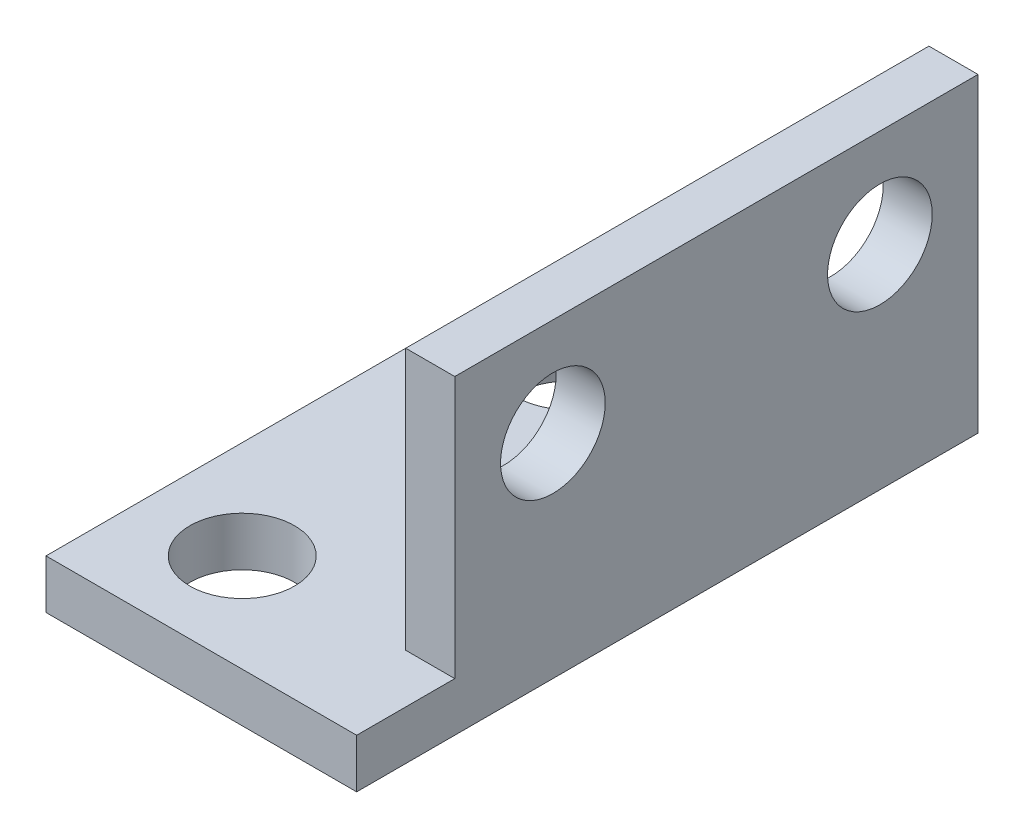
ISO-10303-21;
HEADER;
FILE_DESCRIPTION(('STEP AP214'),'2;1');
FILE_NAME('part.step','',(''),(''),'','','');
FILE_SCHEMA(('AUTOMOTIVE_DESIGN { 1 0 10303 214 1 1 1 1 }'));
ENDSEC;
DATA;
#1=APPLICATION_CONTEXT('core data for automotive mechanical design processes');
#2=APPLICATION_PROTOCOL_DEFINITION('international standard','automotive_design',2000,#1);
#3=PRODUCT_CONTEXT('',#1,'mechanical');
#4=PRODUCT('Part','Part','',(#3));
#5=PRODUCT_RELATED_PRODUCT_CATEGORY('part','',(#4));
#6=PRODUCT_DEFINITION_FORMATION('','',#4);
#7=PRODUCT_DEFINITION_CONTEXT('part definition',#1,'design');
#8=PRODUCT_DEFINITION('design','',#6,#7);
#9=PRODUCT_DEFINITION_SHAPE('','',#8);
#10=(LENGTH_UNIT() NAMED_UNIT(*) SI_UNIT(.MILLI.,.METRE.));
#11=(NAMED_UNIT(*) PLANE_ANGLE_UNIT() SI_UNIT($,.RADIAN.));
#12=(NAMED_UNIT(*) SI_UNIT($,.STERADIAN.) SOLID_ANGLE_UNIT());
#13=UNCERTAINTY_MEASURE_WITH_UNIT(LENGTH_MEASURE(1.E-05),#10,'distance_accuracy_value','');
#14=(GEOMETRIC_REPRESENTATION_CONTEXT(3) GLOBAL_UNCERTAINTY_ASSIGNED_CONTEXT((#13)) GLOBAL_UNIT_ASSIGNED_CONTEXT((#10,
#11,#12)) REPRESENTATION_CONTEXT('',''));
#15=CARTESIAN_POINT('',(0.,0.,0.));
#16=DIRECTION('',(0.,0.,1.));
#17=DIRECTION('',(1.,0.,0.));
#18=AXIS2_PLACEMENT_3D('',#15,#16,#17);
#19=CARTESIAN_POINT('',(0.,1.5,0.));
#20=DIRECTION('',(0.,-1.,0.));
#21=DIRECTION('',(0.,0.,-1.));
#22=AXIS2_PLACEMENT_3D('',#19,#20,#21);
#23=PLANE('',#22);
#24=DIRECTION('',(0.,0.,1.));
#25=VECTOR('',#24,1.);
#26=CARTESIAN_POINT('',(6.5,1.5,0.));
#27=LINE('',#26,#25);
#28=CARTESIAN_POINT('',(6.5,1.5,10.));
#29=VERTEX_POINT('',#28);
#30=CARTESIAN_POINT('',(6.5,1.5,13.));
#31=VERTEX_POINT('',#30);
#32=EDGE_CURVE('E51',#29,#31,#27,.T.);
#33=ORIENTED_EDGE('',*,*,#32,.F.);
#34=DIRECTION('',(1.,0.,0.));
#35=VECTOR('',#34,1.);
#36=CARTESIAN_POINT('',(-16.242645786248,1.5,10.));
#37=LINE('',#36,#35);
#38=CARTESIAN_POINT('',(5.,1.5,10.));
#39=VERTEX_POINT('',#38);
#40=EDGE_CURVE('E129',#39,#29,#37,.T.);
#41=ORIENTED_EDGE('',*,*,#40,.F.);
#42=DIRECTION('',(0.,0.,1.));
#43=VECTOR('',#42,1.);
#44=CARTESIAN_POINT('',(5.,1.5,-8.));
#45=LINE('',#44,#43);
#46=CARTESIAN_POINT('',(5.,1.5,-3.));
#47=VERTEX_POINT('',#46);
#48=EDGE_CURVE('E122',#47,#39,#45,.T.);
#49=ORIENTED_EDGE('',*,*,#48,.F.);
#50=DIRECTION('',(1.,0.,0.));
#51=VECTOR('',#50,1.);
#52=CARTESIAN_POINT('',(-3.,1.5,-3.));
#53=LINE('',#52,#51);
#54=CARTESIAN_POINT('',(-3.,1.5,-3.));
#55=VERTEX_POINT('',#54);
#56=EDGE_CURVE('E59',#55,#47,#53,.T.);
#57=ORIENTED_EDGE('',*,*,#56,.F.);
#58=DIRECTION('',(0.,0.,1.));
#59=VECTOR('',#58,1.);
#60=CARTESIAN_POINT('',(-3.,1.5,-8.));
#61=LINE('',#60,#59);
#62=CARTESIAN_POINT('',(-3.,1.5,13.));
#63=VERTEX_POINT('',#62);
#64=EDGE_CURVE('E177',#55,#63,#61,.T.);
#65=ORIENTED_EDGE('',*,*,#64,.T.);
#66=DIRECTION('',(1.,0.,0.));
#67=VECTOR('',#66,1.);
#68=CARTESIAN_POINT('',(-3.,1.5,13.));
#69=LINE('',#68,#67);
#70=EDGE_CURVE('E175',#63,#31,#69,.T.);
#71=ORIENTED_EDGE('',*,*,#70,.T.);
#72=EDGE_LOOP('',(#33,#41,#49,#57,#65,#71));
#73=FACE_BOUND('',#72,.T.);
#74=CARTESIAN_POINT('',(0.,1.5,0.));
#75=DIRECTION('',(0.,1.,0.));
#76=DIRECTION('',(0.,0.,1.));
#77=AXIS2_PLACEMENT_3D('',#74,#75,#76);
#78=CIRCLE('',#77,1.6);
#79=CARTESIAN_POINT('',(0.,1.5,1.6));
#80=VERTEX_POINT('',#79);
#81=EDGE_CURVE('E169',#80,#80,#78,.T.);
#82=ORIENTED_EDGE('',*,*,#81,.F.);
#83=EDGE_LOOP('',(#82));
#84=FACE_BOUND('',#83,.T.);
#85=CARTESIAN_POINT('',(0.,1.5,10.));
#86=DIRECTION('',(0.,1.,0.));
#87=DIRECTION('',(0.,0.,1.));
#88=AXIS2_PLACEMENT_3D('',#85,#86,#87);
#89=CIRCLE('',#88,1.6);
#90=CARTESIAN_POINT('',(0.,1.5,11.6));
#91=VERTEX_POINT('',#90);
#92=EDGE_CURVE('E163',#91,#91,#89,.T.);
#93=ORIENTED_EDGE('',*,*,#92,.F.);
#94=EDGE_LOOP('',(#93));
#95=FACE_BOUND('',#94,.T.);
#96=ADVANCED_FACE('F36',(#73,#84,#95),#23,.F.);
#97=CARTESIAN_POINT('',(0.,0.,0.));
#98=DIRECTION('',(0.,-1.,0.));
#99=DIRECTION('',(0.,0.,-1.));
#100=AXIS2_PLACEMENT_3D('',#97,#98,#99);
#101=PLANE('',#100);
#102=DIRECTION('',(0.,0.,-1.));
#103=VECTOR('',#102,1.);
#104=CARTESIAN_POINT('',(6.5,0.,0.));
#105=LINE('',#104,#103);
#106=CARTESIAN_POINT('',(6.5,0.,13.));
#107=VERTEX_POINT('',#106);
#108=CARTESIAN_POINT('',(6.5,0.,-6.));
#109=VERTEX_POINT('',#108);
#110=EDGE_CURVE('E182',#107,#109,#105,.T.);
#111=ORIENTED_EDGE('',*,*,#110,.F.);
#112=DIRECTION('',(1.,0.,0.));
#113=VECTOR('',#112,1.);
#114=CARTESIAN_POINT('',(6.5,0.,13.));
#115=LINE('',#114,#113);
#116=CARTESIAN_POINT('',(-3.,0.,13.));
#117=VERTEX_POINT('',#116);
#118=EDGE_CURVE('E172',#117,#107,#115,.T.);
#119=ORIENTED_EDGE('',*,*,#118,.F.);
#120=DIRECTION('',(0.,0.,1.));
#121=VECTOR('',#120,1.);
#122=CARTESIAN_POINT('',(-3.,0.,-8.));
#123=LINE('',#122,#121);
#124=CARTESIAN_POINT('',(-3.,0.,-3.));
#125=VERTEX_POINT('',#124);
#126=EDGE_CURVE('E178',#125,#117,#123,.T.);
#127=ORIENTED_EDGE('',*,*,#126,.F.);
#128=DIRECTION('',(-1.,0.,0.));
#129=VECTOR('',#128,1.);
#130=CARTESIAN_POINT('',(0.,0.,-3.));
#131=LINE('',#130,#129);
#132=CARTESIAN_POINT('',(5.,0.,-3.));
#133=VERTEX_POINT('',#132);
#134=EDGE_CURVE('E156',#133,#125,#131,.T.);
#135=ORIENTED_EDGE('',*,*,#134,.F.);
#136=DIRECTION('',(0.,0.,1.));
#137=VECTOR('',#136,1.);
#138=CARTESIAN_POINT('',(5.,0.,0.));
#139=LINE('',#138,#137);
#140=CARTESIAN_POINT('',(5.,0.,-6.));
#141=VERTEX_POINT('',#140);
#142=EDGE_CURVE('E158',#141,#133,#139,.T.);
#143=ORIENTED_EDGE('',*,*,#142,.F.);
#144=DIRECTION('',(1.,0.,0.));
#145=VECTOR('',#144,1.);
#146=CARTESIAN_POINT('',(5.,0.,-6.));
#147=LINE('',#146,#145);
#148=EDGE_CURVE('E141',#141,#109,#147,.T.);
#149=ORIENTED_EDGE('',*,*,#148,.T.);
#150=EDGE_LOOP('',(#111,#119,#127,#135,#143,#149));
#151=FACE_BOUND('',#150,.T.);
#152=CARTESIAN_POINT('',(0.,0.,0.));
#153=DIRECTION('',(0.,1.,0.));
#154=DIRECTION('',(0.,0.,1.));
#155=AXIS2_PLACEMENT_3D('',#152,#153,#154);
#156=CIRCLE('',#155,1.6);
#157=CARTESIAN_POINT('',(0.,0.,1.6));
#158=VERTEX_POINT('',#157);
#159=EDGE_CURVE('E166',#158,#158,#156,.T.);
#160=ORIENTED_EDGE('',*,*,#159,.T.);
#161=EDGE_LOOP('',(#160));
#162=FACE_BOUND('',#161,.T.);
#163=CARTESIAN_POINT('',(0.,0.,10.));
#164=DIRECTION('',(0.,1.,0.));
#165=DIRECTION('',(0.,0.,1.));
#166=AXIS2_PLACEMENT_3D('',#163,#164,#165);
#167=CIRCLE('',#166,1.6);
#168=CARTESIAN_POINT('',(0.,0.,11.6));
#169=VERTEX_POINT('',#168);
#170=EDGE_CURVE('E114',#169,#169,#167,.T.);
#171=ORIENTED_EDGE('',*,*,#170,.T.);
#172=EDGE_LOOP('',(#171));
#173=FACE_BOUND('',#172,.T.);
#174=ADVANCED_FACE('F198',(#151,#162,#173),#101,.T.);
#175=CARTESIAN_POINT('',(6.5,1.5,13.));
#176=DIRECTION('',(0.,0.,-1.));
#177=DIRECTION('',(-1.,0.,0.));
#178=AXIS2_PLACEMENT_3D('',#175,#176,#177);
#179=PLANE('',#178);
#180=DIRECTION('',(0.,-1.,0.));
#181=VECTOR('',#180,1.);
#182=CARTESIAN_POINT('',(6.5,1.5,13.));
#183=LINE('',#182,#181);
#184=EDGE_CURVE('E44',#31,#107,#183,.T.);
#185=ORIENTED_EDGE('',*,*,#184,.F.);
#186=ORIENTED_EDGE('',*,*,#70,.F.);
#187=DIRECTION('',(0.,-1.,0.));
#188=VECTOR('',#187,1.);
#189=CARTESIAN_POINT('',(-3.,1.5,13.));
#190=LINE('',#189,#188);
#191=EDGE_CURVE('E180',#63,#117,#190,.T.);
#192=ORIENTED_EDGE('',*,*,#191,.T.);
#193=ORIENTED_EDGE('',*,*,#118,.T.);
#194=EDGE_LOOP('',(#185,#186,#192,#193));
#195=FACE_BOUND('',#194,.T.);
#196=ADVANCED_FACE('F38',(#195),#179,.F.);
#197=CARTESIAN_POINT('',(6.5,1.5,0.));
#198=DIRECTION('',(-1.,0.,0.));
#199=DIRECTION('',(0.,0.,1.));
#200=AXIS2_PLACEMENT_3D('',#197,#198,#199);
#201=PLANE('',#200);
#202=ORIENTED_EDGE('',*,*,#110,.T.);
#203=DIRECTION('',(0.,-1.,0.));
#204=VECTOR('',#203,1.);
#205=CARTESIAN_POINT('',(6.5,0.,-6.));
#206=LINE('',#205,#204);
#207=CARTESIAN_POINT('',(6.5,9.5,-6.));
#208=VERTEX_POINT('',#207);
#209=EDGE_CURVE('E124',#208,#109,#206,.T.);
#210=ORIENTED_EDGE('',*,*,#209,.F.);
#211=DIRECTION('',(0.,0.,-1.));
#212=VECTOR('',#211,1.);
#213=CARTESIAN_POINT('',(6.5,9.5,13.));
#214=LINE('',#213,#212);
#215=CARTESIAN_POINT('',(6.5,9.5,10.));
#216=VERTEX_POINT('',#215);
#217=EDGE_CURVE('E115',#216,#208,#214,.T.);
#218=ORIENTED_EDGE('',*,*,#217,.F.);
#219=DIRECTION('',(0.,-1.,0.));
#220=VECTOR('',#219,1.);
#221=CARTESIAN_POINT('',(6.5,0.,10.));
#222=LINE('',#221,#220);
#223=EDGE_CURVE('E125',#216,#29,#222,.T.);
#224=ORIENTED_EDGE('',*,*,#223,.T.);
#225=ORIENTED_EDGE('',*,*,#32,.T.);
#226=ORIENTED_EDGE('',*,*,#184,.T.);
#227=EDGE_LOOP('',(#202,#210,#218,#224,#225,#226));
#228=FACE_BOUND('',#227,.T.);
#229=CARTESIAN_POINT('',(6.5,6.5,-3.));
#230=DIRECTION('',(1.,0.,0.));
#231=DIRECTION('',(0.,0.,-1.));
#232=AXIS2_PLACEMENT_3D('',#229,#230,#231);
#233=CIRCLE('',#232,1.6);
#234=CARTESIAN_POINT('',(6.5,6.5,-4.6));
#235=VERTEX_POINT('',#234);
#236=EDGE_CURVE('E138',#235,#235,#233,.T.);
#237=ORIENTED_EDGE('',*,*,#236,.F.);
#238=EDGE_LOOP('',(#237));
#239=FACE_BOUND('',#238,.T.);
#240=CARTESIAN_POINT('',(6.5,6.5,7.));
#241=DIRECTION('',(1.,0.,0.));
#242=DIRECTION('',(0.,0.,-1.));
#243=AXIS2_PLACEMENT_3D('',#240,#241,#242);
#244=CIRCLE('',#243,1.6);
#245=CARTESIAN_POINT('',(6.5,6.5,5.4));
#246=VERTEX_POINT('',#245);
#247=EDGE_CURVE('E137',#246,#246,#244,.T.);
#248=ORIENTED_EDGE('',*,*,#247,.F.);
#249=EDGE_LOOP('',(#248));
#250=FACE_BOUND('',#249,.T.);
#251=ADVANCED_FACE('F191',(#228,#239,#250),#201,.F.);
#252=CARTESIAN_POINT('',(-3.,1.5,-8.));
#253=DIRECTION('',(1.,0.,0.));
#254=DIRECTION('',(0.,0.,-1.));
#255=AXIS2_PLACEMENT_3D('',#252,#253,#254);
#256=PLANE('',#255);
#257=ORIENTED_EDGE('',*,*,#64,.F.);
#258=DIRECTION('',(0.,-1.,0.));
#259=VECTOR('',#258,1.);
#260=CARTESIAN_POINT('',(-3.,1.5,-3.));
#261=LINE('',#260,#259);
#262=EDGE_CURVE('E11',#55,#125,#261,.T.);
#263=ORIENTED_EDGE('',*,*,#262,.T.);
#264=ORIENTED_EDGE('',*,*,#126,.T.);
#265=ORIENTED_EDGE('',*,*,#191,.F.);
#266=EDGE_LOOP('',(#257,#263,#264,#265));
#267=FACE_BOUND('',#266,.T.);
#268=ADVANCED_FACE('F209',(#267),#256,.F.);
#269=CARTESIAN_POINT('',(0.,1.5,0.));
#270=DIRECTION('',(0.,-1.,0.));
#271=DIRECTION('',(0.,0.,-1.));
#272=AXIS2_PLACEMENT_3D('',#269,#270,#271);
#273=CYLINDRICAL_SURFACE('',#272,1.6);
#274=ORIENTED_EDGE('',*,*,#81,.T.);
#275=EDGE_LOOP('',(#274));
#276=FACE_BOUND('',#275,.T.);
#277=ORIENTED_EDGE('',*,*,#159,.F.);
#278=EDGE_LOOP('',(#277));
#279=FACE_BOUND('',#278,.T.);
#280=ADVANCED_FACE('F222',(#276,#279),#273,.F.);
#281=CARTESIAN_POINT('',(0.,1.5,10.));
#282=DIRECTION('',(0.,-1.,0.));
#283=DIRECTION('',(0.,0.,-1.));
#284=AXIS2_PLACEMENT_3D('',#281,#282,#283);
#285=CYLINDRICAL_SURFACE('',#284,1.6);
#286=ORIENTED_EDGE('',*,*,#92,.T.);
#287=EDGE_LOOP('',(#286));
#288=FACE_BOUND('',#287,.T.);
#289=ORIENTED_EDGE('',*,*,#170,.F.);
#290=EDGE_LOOP('',(#289));
#291=FACE_BOUND('',#290,.T.);
#292=ADVANCED_FACE('F229',(#288,#291),#285,.F.);
#293=CARTESIAN_POINT('',(5.,9.5,-8.));
#294=DIRECTION('',(1.,0.,0.));
#295=DIRECTION('',(0.,0.,-1.));
#296=AXIS2_PLACEMENT_3D('',#293,#294,#295);
#297=PLANE('',#296);
#298=DIRECTION('',(0.,0.,1.));
#299=VECTOR('',#298,1.);
#300=CARTESIAN_POINT('',(5.,9.5,-8.));
#301=LINE('',#300,#299);
#302=CARTESIAN_POINT('',(5.,9.5,-6.));
#303=VERTEX_POINT('',#302);
#304=CARTESIAN_POINT('',(5.,9.5,10.));
#305=VERTEX_POINT('',#304);
#306=EDGE_CURVE('E104',#303,#305,#301,.T.);
#307=ORIENTED_EDGE('',*,*,#306,.F.);
#308=DIRECTION('',(0.,-1.,0.));
#309=VECTOR('',#308,1.);
#310=CARTESIAN_POINT('',(5.,0.,-6.));
#311=LINE('',#310,#309);
#312=EDGE_CURVE('E142',#303,#141,#311,.T.);
#313=ORIENTED_EDGE('',*,*,#312,.T.);
#314=ORIENTED_EDGE('',*,*,#142,.T.);
#315=DIRECTION('',(0.,1.,0.));
#316=VECTOR('',#315,1.);
#317=CARTESIAN_POINT('',(5.,-6.5,-3.));
#318=LINE('',#317,#316);
#319=EDGE_CURVE('E154',#133,#47,#318,.T.);
#320=ORIENTED_EDGE('',*,*,#319,.T.);
#321=ORIENTED_EDGE('',*,*,#48,.T.);
#322=DIRECTION('',(0.,1.,0.));
#323=VECTOR('',#322,1.);
#324=CARTESIAN_POINT('',(5.,0.,10.));
#325=LINE('',#324,#323);
#326=EDGE_CURVE('E118',#39,#305,#325,.T.);
#327=ORIENTED_EDGE('',*,*,#326,.T.);
#328=EDGE_LOOP('',(#307,#313,#314,#320,#321,#327));
#329=FACE_BOUND('',#328,.T.);
#330=CARTESIAN_POINT('',(5.,6.5,-3.));
#331=DIRECTION('',(1.,0.,0.));
#332=DIRECTION('',(0.,0.,-1.));
#333=AXIS2_PLACEMENT_3D('',#330,#331,#332);
#334=CIRCLE('',#333,1.6);
#335=CARTESIAN_POINT('',(5.,6.5,-4.6));
#336=VERTEX_POINT('',#335);
#337=EDGE_CURVE('E134',#336,#336,#334,.T.);
#338=ORIENTED_EDGE('',*,*,#337,.T.);
#339=EDGE_LOOP('',(#338));
#340=FACE_BOUND('',#339,.T.);
#341=CARTESIAN_POINT('',(5.,6.5,7.));
#342=DIRECTION('',(1.,0.,0.));
#343=DIRECTION('',(0.,0.,-1.));
#344=AXIS2_PLACEMENT_3D('',#341,#342,#343);
#345=CIRCLE('',#344,1.6);
#346=CARTESIAN_POINT('',(5.,6.5,5.4));
#347=VERTEX_POINT('',#346);
#348=EDGE_CURVE('E148',#347,#347,#345,.T.);
#349=ORIENTED_EDGE('',*,*,#348,.T.);
#350=EDGE_LOOP('',(#349));
#351=FACE_BOUND('',#350,.T.);
#352=ADVANCED_FACE('F119',(#329,#340,#351),#297,.F.);
#353=CARTESIAN_POINT('',(0.,9.5,0.));
#354=DIRECTION('',(0.,1.,0.));
#355=DIRECTION('',(0.,0.,1.));
#356=AXIS2_PLACEMENT_3D('',#353,#354,#355);
#357=PLANE('',#356);
#358=DIRECTION('',(1.,0.,0.));
#359=VECTOR('',#358,1.);
#360=CARTESIAN_POINT('',(5.,9.5,-6.));
#361=LINE('',#360,#359);
#362=EDGE_CURVE('E111',#303,#208,#361,.T.);
#363=ORIENTED_EDGE('',*,*,#362,.F.);
#364=ORIENTED_EDGE('',*,*,#306,.T.);
#365=DIRECTION('',(1.,0.,0.));
#366=VECTOR('',#365,1.);
#367=CARTESIAN_POINT('',(-16.242645786248,9.5,10.));
#368=LINE('',#367,#366);
#369=EDGE_CURVE('E109',#305,#216,#368,.T.);
#370=ORIENTED_EDGE('',*,*,#369,.T.);
#371=ORIENTED_EDGE('',*,*,#217,.T.);
#372=EDGE_LOOP('',(#363,#364,#370,#371));
#373=FACE_BOUND('',#372,.T.);
#374=ADVANCED_FACE('F106',(#373),#357,.T.);
#375=CARTESIAN_POINT('',(-3.,-6.5,-3.));
#376=DIRECTION('',(0.,0.,1.));
#377=DIRECTION('',(1.,0.,0.));
#378=AXIS2_PLACEMENT_3D('',#375,#376,#377);
#379=PLANE('',#378);
#380=ORIENTED_EDGE('',*,*,#134,.T.);
#381=ORIENTED_EDGE('',*,*,#262,.F.);
#382=ORIENTED_EDGE('',*,*,#56,.T.);
#383=ORIENTED_EDGE('',*,*,#319,.F.);
#384=EDGE_LOOP('',(#380,#381,#382,#383));
#385=FACE_BOUND('',#384,.T.);
#386=ADVANCED_FACE('F205',(#385),#379,.F.);
#387=CARTESIAN_POINT('',(5.,6.5,7.));
#388=DIRECTION('',(1.,0.,0.));
#389=DIRECTION('',(0.,0.,-1.));
#390=AXIS2_PLACEMENT_3D('',#387,#388,#389);
#391=CYLINDRICAL_SURFACE('',#390,1.6);
#392=ORIENTED_EDGE('',*,*,#247,.T.);
#393=EDGE_LOOP('',(#392));
#394=FACE_BOUND('',#393,.T.);
#395=ORIENTED_EDGE('',*,*,#348,.F.);
#396=EDGE_LOOP('',(#395));
#397=FACE_BOUND('',#396,.T.);
#398=ADVANCED_FACE('F252',(#394,#397),#391,.F.);
#399=CARTESIAN_POINT('',(5.,0.,-6.));
#400=DIRECTION('',(0.,0.,1.));
#401=DIRECTION('',(0.,-1.,0.));
#402=AXIS2_PLACEMENT_3D('',#399,#400,#401);
#403=PLANE('',#402);
#404=ORIENTED_EDGE('',*,*,#209,.T.);
#405=ORIENTED_EDGE('',*,*,#148,.F.);
#406=ORIENTED_EDGE('',*,*,#312,.F.);
#407=ORIENTED_EDGE('',*,*,#362,.T.);
#408=EDGE_LOOP('',(#404,#405,#406,#407));
#409=FACE_BOUND('',#408,.T.);
#410=ADVANCED_FACE('F204',(#409),#403,.F.);
#411=CARTESIAN_POINT('',(5.,6.5,-3.));
#412=DIRECTION('',(1.,0.,0.));
#413=DIRECTION('',(0.,0.,-1.));
#414=AXIS2_PLACEMENT_3D('',#411,#412,#413);
#415=CYLINDRICAL_SURFACE('',#414,1.6);
#416=ORIENTED_EDGE('',*,*,#236,.T.);
#417=EDGE_LOOP('',(#416));
#418=FACE_BOUND('',#417,.T.);
#419=ORIENTED_EDGE('',*,*,#337,.F.);
#420=EDGE_LOOP('',(#419));
#421=FACE_BOUND('',#420,.T.);
#422=ADVANCED_FACE('F258',(#418,#421),#415,.F.);
#423=CARTESIAN_POINT('',(-16.242645786248,0.,10.));
#424=DIRECTION('',(0.,0.,1.));
#425=DIRECTION('',(1.,0.,0.));
#426=AXIS2_PLACEMENT_3D('',#423,#424,#425);
#427=PLANE('',#426);
#428=ORIENTED_EDGE('',*,*,#326,.F.);
#429=ORIENTED_EDGE('',*,*,#40,.T.);
#430=ORIENTED_EDGE('',*,*,#223,.F.);
#431=ORIENTED_EDGE('',*,*,#369,.F.);
#432=EDGE_LOOP('',(#428,#429,#430,#431));
#433=FACE_BOUND('',#432,.T.);
#434=ADVANCED_FACE('F127',(#433),#427,.T.);
#435=CLOSED_SHELL('',(#96,#174,#196,#251,#268,#280,#292,#352,#374,#386,#398,#410,#422,#434));
#436=MANIFOLD_SOLID_BREP('B2',#435);
#437=ADVANCED_BREP_SHAPE_REPRESENTATION('',(#18,#436),#14);
#438=SHAPE_DEFINITION_REPRESENTATION(#9,#437);
ENDSEC;
END-ISO-10303-21;
